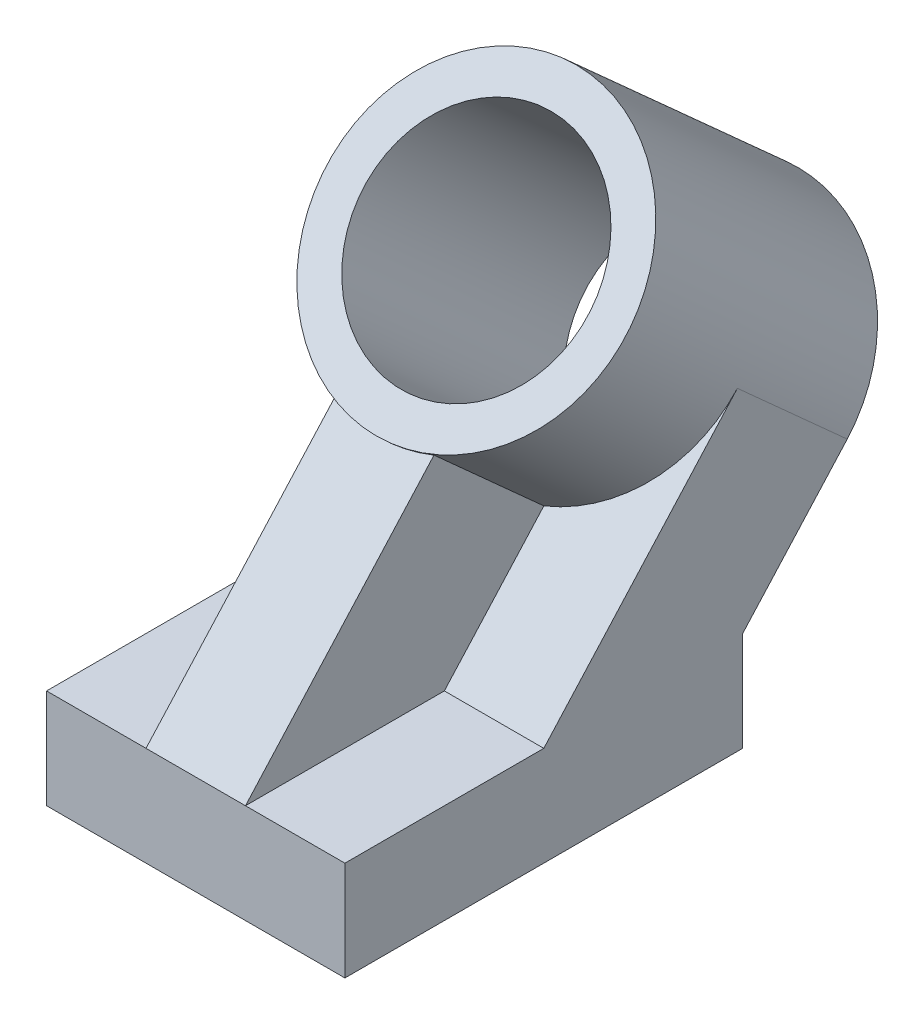
ISO-10303-21;
HEADER;
FILE_DESCRIPTION(('STEP AP214'),'2;1');
FILE_NAME('part.step','',(''),(''),'','','');
FILE_SCHEMA(('AUTOMOTIVE_DESIGN { 1 0 10303 214 1 1 1 1 }'));
ENDSEC;
DATA;
#1=APPLICATION_CONTEXT('core data for automotive mechanical design processes');
#2=APPLICATION_PROTOCOL_DEFINITION('international standard','automotive_design',2000,#1);
#3=PRODUCT_CONTEXT('',#1,'mechanical');
#4=PRODUCT('Part','Part','',(#3));
#5=PRODUCT_RELATED_PRODUCT_CATEGORY('part','',(#4));
#6=PRODUCT_DEFINITION_FORMATION('','',#4);
#7=PRODUCT_DEFINITION_CONTEXT('part definition',#1,'design');
#8=PRODUCT_DEFINITION('design','',#6,#7);
#9=PRODUCT_DEFINITION_SHAPE('','',#8);
#10=(LENGTH_UNIT() NAMED_UNIT(*) SI_UNIT(.MILLI.,.METRE.));
#11=(NAMED_UNIT(*) PLANE_ANGLE_UNIT() SI_UNIT($,.RADIAN.));
#12=(NAMED_UNIT(*) SI_UNIT($,.STERADIAN.) SOLID_ANGLE_UNIT());
#13=UNCERTAINTY_MEASURE_WITH_UNIT(LENGTH_MEASURE(1.E-05),#10,'distance_accuracy_value','');
#14=(GEOMETRIC_REPRESENTATION_CONTEXT(3) GLOBAL_UNCERTAINTY_ASSIGNED_CONTEXT((#13)) GLOBAL_UNIT_ASSIGNED_CONTEXT((#10,
#11,#12)) REPRESENTATION_CONTEXT('',''));
#15=CARTESIAN_POINT('',(0.,0.,0.));
#16=DIRECTION('',(0.,0.,1.));
#17=DIRECTION('',(1.,0.,0.));
#18=AXIS2_PLACEMENT_3D('',#15,#16,#17);
#19=CARTESIAN_POINT('',(38.1,25.4,-50.8));
#20=DIRECTION('',(0.,-0.669130606358859,-0.743144825477393));
#21=DIRECTION('',(0.,0.743144825477393,-0.669130606358859));
#22=AXIS2_PLACEMENT_3D('',#19,#20,#21);
#23=PLANE('',#22);
#24=DIRECTION('',(0.,-0.743144825477393,0.669130606358859));
#25=VECTOR('',#24,1.);
#26=CARTESIAN_POINT('',(38.1,25.4,-50.8));
#27=LINE('',#26,#25);
#28=CARTESIAN_POINT('',(38.1,80.3137421906527,-100.244555555993));
#29=VERTEX_POINT('',#28);
#30=CARTESIAN_POINT('',(38.1,25.4,-50.8));
#31=VERTEX_POINT('',#30);
#32=EDGE_CURVE('E188',#29,#31,#27,.T.);
#33=ORIENTED_EDGE('',*,*,#32,.F.);
#34=CARTESIAN_POINT('',(0.,80.3137421906527,-100.244555555993));
#35=DIRECTION('',(0.,-0.669130606358859,-0.743144825477393));
#36=DIRECTION('',(0.,0.743144825477393,-0.669130606358859));
#37=AXIS2_PLACEMENT_3D('',#34,#35,#36);
#38=CIRCLE('',#37,38.1);
#39=CARTESIAN_POINT('',(12.7,53.6192187193158,-76.2086986617973));
#40=VERTEX_POINT('',#39);
#41=EDGE_CURVE('E55',#29,#40,#38,.T.);
#42=ORIENTED_EDGE('',*,*,#41,.T.);
#43=DIRECTION('',(0.,0.743144825477393,-0.669130606358859));
#44=VECTOR('',#43,1.);
#45=CARTESIAN_POINT('',(12.7,0.139143857645851,-28.0550229669983));
#46=LINE('',#45,#44);
#47=CARTESIAN_POINT('',(12.7,25.4,-50.8));
#48=VERTEX_POINT('',#47);
#49=EDGE_CURVE('E138',#48,#40,#46,.T.);
#50=ORIENTED_EDGE('',*,*,#49,.F.);
#51=DIRECTION('',(-1.,0.,0.));
#52=VECTOR('',#51,1.);
#53=CARTESIAN_POINT('',(38.1,25.4,-50.8));
#54=LINE('',#53,#52);
#55=EDGE_CURVE('E229',#31,#48,#54,.T.);
#56=ORIENTED_EDGE('',*,*,#55,.F.);
#57=EDGE_LOOP('',(#33,#42,#50,#56));
#58=FACE_BOUND('',#57,.T.);
#59=ADVANCED_FACE('F39',(#58),#23,.F.);
#60=CARTESIAN_POINT('',(38.1,25.4,0.));
#61=DIRECTION('',(0.,-1.,0.));
#62=DIRECTION('',(0.,0.,-1.));
#63=AXIS2_PLACEMENT_3D('',#60,#61,#62);
#64=PLANE('',#63);
#65=DIRECTION('',(0.,0.,-1.));
#66=VECTOR('',#65,1.);
#67=CARTESIAN_POINT('',(-12.7,25.4,-68.7419602948247));
#68=LINE('',#67,#66);
#69=CARTESIAN_POINT('',(-12.7,25.4,0.));
#70=VERTEX_POINT('',#69);
#71=CARTESIAN_POINT('',(-12.7,25.4,-50.8));
#72=VERTEX_POINT('',#71);
#73=EDGE_CURVE('E170',#70,#72,#68,.T.);
#74=ORIENTED_EDGE('',*,*,#73,.T.);
#75=CARTESIAN_POINT('',(-38.1,25.4,-50.8));
#76=VERTEX_POINT('',#75);
#77=EDGE_CURVE('E228',#72,#76,#54,.T.);
#78=ORIENTED_EDGE('',*,*,#77,.T.);
#79=DIRECTION('',(0.,0.,1.));
#80=VECTOR('',#79,1.);
#81=CARTESIAN_POINT('',(-38.1,25.4,0.));
#82=LINE('',#81,#80);
#83=CARTESIAN_POINT('',(-38.1,25.4,0.));
#84=VERTEX_POINT('',#83);
#85=EDGE_CURVE('E214',#76,#84,#82,.T.);
#86=ORIENTED_EDGE('',*,*,#85,.T.);
#87=DIRECTION('',(-1.,0.,0.));
#88=VECTOR('',#87,1.);
#89=CARTESIAN_POINT('',(38.1,25.4,0.));
#90=LINE('',#89,#88);
#91=EDGE_CURVE('E223',#70,#84,#90,.T.);
#92=ORIENTED_EDGE('',*,*,#91,.F.);
#93=EDGE_LOOP('',(#74,#78,#86,#92));
#94=FACE_BOUND('',#93,.T.);
#95=ADVANCED_FACE('F266',(#94),#64,.F.);
#96=CARTESIAN_POINT('',(38.1,0.,-101.6));
#97=DIRECTION('',(0.,1.,0.));
#98=DIRECTION('',(0.,0.,1.));
#99=AXIS2_PLACEMENT_3D('',#96,#97,#98);
#100=PLANE('',#99);
#101=DIRECTION('',(0.,0.,-1.));
#102=VECTOR('',#101,1.);
#103=CARTESIAN_POINT('',(-38.1,0.,-101.6));
#104=LINE('',#103,#102);
#105=CARTESIAN_POINT('',(-38.1,0.,0.));
#106=VERTEX_POINT('',#105);
#107=CARTESIAN_POINT('',(-38.1,0.,-101.6));
#108=VERTEX_POINT('',#107);
#109=EDGE_CURVE('E133',#106,#108,#104,.T.);
#110=ORIENTED_EDGE('',*,*,#109,.T.);
#111=DIRECTION('',(-1.,0.,0.));
#112=VECTOR('',#111,1.);
#113=CARTESIAN_POINT('',(38.1,0.,-101.6));
#114=LINE('',#113,#112);
#115=CARTESIAN_POINT('',(38.1,0.,-101.6));
#116=VERTEX_POINT('',#115);
#117=EDGE_CURVE('E48',#116,#108,#114,.T.);
#118=ORIENTED_EDGE('',*,*,#117,.F.);
#119=DIRECTION('',(0.,0.,-1.));
#120=VECTOR('',#119,1.);
#121=CARTESIAN_POINT('',(38.1,0.,-101.6));
#122=LINE('',#121,#120);
#123=CARTESIAN_POINT('',(38.1,0.,0.));
#124=VERTEX_POINT('',#123);
#125=EDGE_CURVE('E174',#124,#116,#122,.T.);
#126=ORIENTED_EDGE('',*,*,#125,.F.);
#127=DIRECTION('',(-1.,0.,0.));
#128=VECTOR('',#127,1.);
#129=CARTESIAN_POINT('',(38.1,0.,0.));
#130=LINE('',#129,#128);
#131=EDGE_CURVE('E197',#124,#106,#130,.T.);
#132=ORIENTED_EDGE('',*,*,#131,.T.);
#133=EDGE_LOOP('',(#110,#118,#126,#132));
#134=FACE_BOUND('',#133,.T.);
#135=ADVANCED_FACE('F41',(#134),#100,.F.);
#136=CARTESIAN_POINT('',(38.1,0.,-101.6));
#137=DIRECTION('',(0.,0.,1.));
#138=DIRECTION('',(1.,0.,0.));
#139=AXIS2_PLACEMENT_3D('',#136,#137,#138);
#140=PLANE('',#139);
#141=DIRECTION('',(0.,1.,0.));
#142=VECTOR('',#141,1.);
#143=CARTESIAN_POINT('',(-38.1,0.,-101.6));
#144=LINE('',#143,#142);
#145=CARTESIAN_POINT('',(-38.1,25.4,-101.6));
#146=VERTEX_POINT('',#145);
#147=EDGE_CURVE('E201',#108,#146,#144,.T.);
#148=ORIENTED_EDGE('',*,*,#147,.T.);
#149=DIRECTION('',(-1.,0.,0.));
#150=VECTOR('',#149,1.);
#151=CARTESIAN_POINT('',(38.1,25.4,-101.6));
#152=LINE('',#151,#150);
#153=CARTESIAN_POINT('',(38.1,25.4,-101.6));
#154=VERTEX_POINT('',#153);
#155=EDGE_CURVE('E233',#154,#146,#152,.T.);
#156=ORIENTED_EDGE('',*,*,#155,.F.);
#157=DIRECTION('',(0.,1.,0.));
#158=VECTOR('',#157,1.);
#159=CARTESIAN_POINT('',(38.1,0.,-101.6));
#160=LINE('',#159,#158);
#161=EDGE_CURVE('E178',#116,#154,#160,.T.);
#162=ORIENTED_EDGE('',*,*,#161,.F.);
#163=ORIENTED_EDGE('',*,*,#117,.T.);
#164=EDGE_LOOP('',(#148,#156,#162,#163));
#165=FACE_BOUND('',#164,.T.);
#166=ADVANCED_FACE('F240',(#165),#140,.F.);
#167=CARTESIAN_POINT('',(38.1,25.4,-101.6));
#168=DIRECTION('',(0.,0.669130606358859,0.743144825477393));
#169=DIRECTION('',(0.,-0.743144825477393,0.669130606358859));
#170=AXIS2_PLACEMENT_3D('',#167,#168,#169);
#171=PLANE('',#170);
#172=CARTESIAN_POINT('',(0.,55.0528860482986,-128.299578522991));
#173=DIRECTION('',(0.,-0.669130606358859,-0.743144825477393));
#174=DIRECTION('',(0.,0.743144825477393,-0.669130606358859));
#175=AXIS2_PLACEMENT_3D('',#172,#173,#174);
#176=CIRCLE('',#175,28.575);
#177=CARTESIAN_POINT('',(0.,76.2882494363151,-147.419985599696));
#178=VERTEX_POINT('',#177);
#179=EDGE_CURVE('E298',#178,#178,#176,.T.);
#180=ORIENTED_EDGE('',*,*,#179,.F.);
#181=EDGE_LOOP('',(#180));
#182=FACE_BOUND('',#181,.T.);
#183=DIRECTION('',(0.,0.743144825477393,-0.66913060635886));
#184=VECTOR('',#183,1.);
#185=CARTESIAN_POINT('',(-38.1,25.4,-101.6));
#186=LINE('',#185,#184);
#187=CARTESIAN_POINT('',(-38.1,55.0528860482986,-128.299578522991));
#188=VERTEX_POINT('',#187);
#189=EDGE_CURVE('E204',#146,#188,#186,.T.);
#190=ORIENTED_EDGE('',*,*,#189,.T.);
#191=CARTESIAN_POINT('',(0.,55.0528860482986,-128.299578522991));
#192=DIRECTION('',(0.,-0.669130606358859,-0.743144825477393));
#193=DIRECTION('',(0.,0.743144825477393,-0.669130606358859));
#194=AXIS2_PLACEMENT_3D('',#191,#192,#193);
#195=CIRCLE('',#194,38.1);
#196=CARTESIAN_POINT('',(38.1,55.0528860482986,-128.299578522991));
#197=VERTEX_POINT('',#196);
#198=EDGE_CURVE('E151',#188,#197,#195,.T.);
#199=ORIENTED_EDGE('',*,*,#198,.T.);
#200=DIRECTION('',(0.,0.743144825477393,-0.66913060635886));
#201=VECTOR('',#200,1.);
#202=CARTESIAN_POINT('',(38.1,25.4,-101.6));
#203=LINE('',#202,#201);
#204=EDGE_CURVE('E182',#154,#197,#203,.T.);
#205=ORIENTED_EDGE('',*,*,#204,.F.);
#206=ORIENTED_EDGE('',*,*,#155,.T.);
#207=EDGE_LOOP('',(#190,#199,#205,#206));
#208=FACE_BOUND('',#207,.T.);
#209=ADVANCED_FACE('F256',(#182,#208),#171,.F.);
#210=DIRECTION('',(0.,0.743144825477393,-0.669130606358859));
#211=VECTOR('',#210,1.);
#212=CARTESIAN_POINT('',(-12.7,0.139143857645851,-28.0550229669983));
#213=LINE('',#212,#211);
#214=CARTESIAN_POINT('',(-12.7,53.6192187193158,-76.2086986617974));
#215=VERTEX_POINT('',#214);
#216=EDGE_CURVE('E160',#72,#215,#213,.T.);
#217=ORIENTED_EDGE('',*,*,#216,.T.);
#218=CARTESIAN_POINT('',(-38.1,80.3137421906527,-100.244555555993));
#219=VERTEX_POINT('',#218);
#220=EDGE_CURVE('E141',#215,#219,#38,.T.);
#221=ORIENTED_EDGE('',*,*,#220,.T.);
#222=DIRECTION('',(0.,-0.743144825477393,0.669130606358859));
#223=VECTOR('',#222,1.);
#224=CARTESIAN_POINT('',(-38.1,25.4,-50.8));
#225=LINE('',#224,#223);
#226=EDGE_CURVE('E210',#219,#76,#225,.T.);
#227=ORIENTED_EDGE('',*,*,#226,.T.);
#228=ORIENTED_EDGE('',*,*,#77,.F.);
#229=EDGE_LOOP('',(#217,#221,#227,#228));
#230=FACE_BOUND('',#229,.T.);
#231=ADVANCED_FACE('F270',(#230),#23,.F.);
#232=ORIENTED_EDGE('',*,*,#55,.T.);
#233=DIRECTION('',(0.,0.,-1.));
#234=VECTOR('',#233,1.);
#235=CARTESIAN_POINT('',(12.7,25.4,-68.7419602948247));
#236=LINE('',#235,#234);
#237=CARTESIAN_POINT('',(12.7,25.4,0.));
#238=VERTEX_POINT('',#237);
#239=EDGE_CURVE('E159',#238,#48,#236,.T.);
#240=ORIENTED_EDGE('',*,*,#239,.F.);
#241=CARTESIAN_POINT('',(38.1,25.4,0.));
#242=VERTEX_POINT('',#241);
#243=EDGE_CURVE('E224',#242,#238,#90,.T.);
#244=ORIENTED_EDGE('',*,*,#243,.F.);
#245=DIRECTION('',(0.,0.,1.));
#246=VECTOR('',#245,1.);
#247=CARTESIAN_POINT('',(38.1,25.4,0.));
#248=LINE('',#247,#246);
#249=EDGE_CURVE('E191',#31,#242,#248,.T.);
#250=ORIENTED_EDGE('',*,*,#249,.F.);
#251=EDGE_LOOP('',(#232,#240,#244,#250));
#252=FACE_BOUND('',#251,.T.);
#253=ADVANCED_FACE('F278',(#252),#64,.F.);
#254=CARTESIAN_POINT('',(38.1,0.,0.));
#255=DIRECTION('',(0.,0.,-1.));
#256=DIRECTION('',(-1.,0.,0.));
#257=AXIS2_PLACEMENT_3D('',#254,#255,#256);
#258=PLANE('',#257);
#259=DIRECTION('',(0.,-1.,0.));
#260=VECTOR('',#259,1.);
#261=CARTESIAN_POINT('',(-38.1,0.,0.));
#262=LINE('',#261,#260);
#263=EDGE_CURVE('E179',#84,#106,#262,.T.);
#264=ORIENTED_EDGE('',*,*,#263,.T.);
#265=ORIENTED_EDGE('',*,*,#131,.F.);
#266=DIRECTION('',(0.,-1.,0.));
#267=VECTOR('',#266,1.);
#268=CARTESIAN_POINT('',(38.1,0.,0.));
#269=LINE('',#268,#267);
#270=EDGE_CURVE('E194',#242,#124,#269,.T.);
#271=ORIENTED_EDGE('',*,*,#270,.F.);
#272=ORIENTED_EDGE('',*,*,#243,.T.);
#273=DIRECTION('',(1.,0.,0.));
#274=VECTOR('',#273,1.);
#275=CARTESIAN_POINT('',(-12.7,25.4,0.));
#276=LINE('',#275,#274);
#277=EDGE_CURVE('E129',#70,#238,#276,.T.);
#278=ORIENTED_EDGE('',*,*,#277,.F.);
#279=ORIENTED_EDGE('',*,*,#91,.T.);
#280=EDGE_LOOP('',(#264,#265,#271,#272,#278,#279));
#281=FACE_BOUND('',#280,.T.);
#282=ADVANCED_FACE('F273',(#281),#258,.F.);
#283=CARTESIAN_POINT('',(38.1,0.,0.));
#284=DIRECTION('',(-1.,0.,0.));
#285=DIRECTION('',(0.,0.,1.));
#286=AXIS2_PLACEMENT_3D('',#283,#284,#285);
#287=PLANE('',#286);
#288=ORIENTED_EDGE('',*,*,#125,.T.);
#289=ORIENTED_EDGE('',*,*,#161,.T.);
#290=ORIENTED_EDGE('',*,*,#204,.T.);
#291=DIRECTION('',(0.,0.669130606358859,0.743144825477393));
#292=VECTOR('',#291,1.);
#293=CARTESIAN_POINT('',(38.1,80.3137421906527,-100.244555555993));
#294=LINE('',#293,#292);
#295=EDGE_CURVE('E185',#197,#29,#294,.T.);
#296=ORIENTED_EDGE('',*,*,#295,.T.);
#297=ORIENTED_EDGE('',*,*,#32,.T.);
#298=ORIENTED_EDGE('',*,*,#249,.T.);
#299=ORIENTED_EDGE('',*,*,#270,.T.);
#300=EDGE_LOOP('',(#288,#289,#290,#296,#297,#298,#299));
#301=FACE_BOUND('',#300,.T.);
#302=ADVANCED_FACE('F260',(#301),#287,.F.);
#303=CARTESIAN_POINT('',(-38.1,0.,0.));
#304=DIRECTION('',(-1.,0.,0.));
#305=DIRECTION('',(0.,0.,1.));
#306=AXIS2_PLACEMENT_3D('',#303,#304,#305);
#307=PLANE('',#306);
#308=ORIENTED_EDGE('',*,*,#109,.F.);
#309=ORIENTED_EDGE('',*,*,#263,.F.);
#310=ORIENTED_EDGE('',*,*,#85,.F.);
#311=ORIENTED_EDGE('',*,*,#226,.F.);
#312=DIRECTION('',(0.,0.669130606358859,0.743144825477393));
#313=VECTOR('',#312,1.);
#314=CARTESIAN_POINT('',(-38.1,80.3137421906527,-100.244555555993));
#315=LINE('',#314,#313);
#316=EDGE_CURVE('E207',#188,#219,#315,.T.);
#317=ORIENTED_EDGE('',*,*,#316,.F.);
#318=ORIENTED_EDGE('',*,*,#189,.F.);
#319=ORIENTED_EDGE('',*,*,#147,.F.);
#320=EDGE_LOOP('',(#308,#309,#310,#311,#317,#318,#319));
#321=FACE_BOUND('',#320,.T.);
#322=ADVANCED_FACE('F248',(#321),#307,.T.);
#323=CARTESIAN_POINT('',(12.7,-36.4955390624219,-68.7419602948247));
#324=DIRECTION('',(1.,0.,0.));
#325=DIRECTION('',(0.,0.,-1.));
#326=AXIS2_PLACEMENT_3D('',#323,#324,#325);
#327=PLANE('',#326);
#328=DIRECTION('',(0.,-0.669130606358859,-0.743144825477393));
#329=VECTOR('',#328,1.);
#330=CARTESIAN_POINT('',(12.7,79.3461147815067,-47.6360859274183));
#331=LINE('',#330,#329);
#332=CARTESIAN_POINT('',(12.7,78.88007486167,-48.153675694799));
#333=VERTEX_POINT('',#332);
#334=EDGE_CURVE('E136',#333,#40,#331,.T.);
#335=ORIENTED_EDGE('',*,*,#334,.F.);
#336=DIRECTION('',(0.,0.743144825477393,-0.669130606358859));
#337=VECTOR('',#336,1.);
#338=CARTESIAN_POINT('',(12.7,25.4,0.));
#339=LINE('',#338,#337);
#340=EDGE_CURVE('E125',#238,#333,#339,.T.);
#341=ORIENTED_EDGE('',*,*,#340,.F.);
#342=ORIENTED_EDGE('',*,*,#239,.T.);
#343=ORIENTED_EDGE('',*,*,#49,.T.);
#344=EDGE_LOOP('',(#335,#341,#342,#343));
#345=FACE_BOUND('',#344,.T.);
#346=ADVANCED_FACE('F137',(#345),#327,.T.);
#347=CARTESIAN_POINT('',(-12.7,-36.4955390624219,-68.7419602948247));
#348=DIRECTION('',(1.,0.,0.));
#349=DIRECTION('',(0.,0.,-1.));
#350=AXIS2_PLACEMENT_3D('',#347,#348,#349);
#351=PLANE('',#350);
#352=DIRECTION('',(0.,0.743144825477393,-0.669130606358859));
#353=VECTOR('',#352,1.);
#354=CARTESIAN_POINT('',(-12.7,25.4,0.));
#355=LINE('',#354,#353);
#356=CARTESIAN_POINT('',(-12.7,78.88007486167,-48.153675694799));
#357=VERTEX_POINT('',#356);
#358=EDGE_CURVE('E162',#70,#357,#355,.T.);
#359=ORIENTED_EDGE('',*,*,#358,.T.);
#360=DIRECTION('',(0.,-0.669130606358859,-0.743144825477393));
#361=VECTOR('',#360,1.);
#362=CARTESIAN_POINT('',(-12.7,79.3461147815068,-47.6360859274183));
#363=LINE('',#362,#361);
#364=EDGE_CURVE('E63',#357,#215,#363,.T.);
#365=ORIENTED_EDGE('',*,*,#364,.T.);
#366=ORIENTED_EDGE('',*,*,#216,.F.);
#367=ORIENTED_EDGE('',*,*,#73,.F.);
#368=EDGE_LOOP('',(#359,#365,#366,#367));
#369=FACE_BOUND('',#368,.T.);
#370=ADVANCED_FACE('F271',(#369),#351,.F.);
#371=CARTESIAN_POINT('',(0.,11.3724885165009,12.6304280711771));
#372=DIRECTION('',(0.,0.669130606358859,0.743144825477393));
#373=DIRECTION('',(0.,-0.743144825477393,0.669130606358859));
#374=AXIS2_PLACEMENT_3D('',#371,#372,#373);
#375=PLANE('',#374);
#376=CARTESIAN_POINT('',(0.,105.574598333007,-72.1895325889945));
#377=DIRECTION('',(0.,0.669130606358859,0.743144825477393));
#378=DIRECTION('',(0.,-0.743144825477393,0.669130606358859));
#379=AXIS2_PLACEMENT_3D('',#376,#377,#378);
#380=CIRCLE('',#379,38.1);
#381=EDGE_CURVE('E11',#357,#333,#380,.T.);
#382=ORIENTED_EDGE('',*,*,#381,.F.);
#383=ORIENTED_EDGE('',*,*,#358,.F.);
#384=ORIENTED_EDGE('',*,*,#277,.T.);
#385=ORIENTED_EDGE('',*,*,#340,.T.);
#386=EDGE_LOOP('',(#382,#383,#384,#385));
#387=FACE_BOUND('',#386,.T.);
#388=ADVANCED_FACE('F127',(#387),#375,.T.);
#389=CARTESIAN_POINT('',(0.,106.040638252844,-71.6719428216138));
#390=DIRECTION('',(0.,-0.669130606358859,-0.743144825477393));
#391=DIRECTION('',(0.,0.743144825477393,-0.669130606358859));
#392=AXIS2_PLACEMENT_3D('',#389,#390,#391);
#393=CYLINDRICAL_SURFACE('',#392,38.1);
#394=CARTESIAN_POINT('',(0.,106.040638252844,-71.6719428216138));
#395=DIRECTION('',(0.,-0.669130606358859,-0.743144825477393));
#396=DIRECTION('',(0.,0.743144825477393,-0.669130606358859));
#397=AXIS2_PLACEMENT_3D('',#394,#395,#396);
#398=CIRCLE('',#397,38.1);
#399=CARTESIAN_POINT('',(0.,134.354456103532,-97.1658189238863));
#400=VERTEX_POINT('',#399);
#401=EDGE_CURVE('E147',#400,#400,#398,.T.);
#402=ORIENTED_EDGE('',*,*,#401,.T.);
#403=EDGE_LOOP('',(#402));
#404=FACE_BOUND('',#403,.T.);
#405=ORIENTED_EDGE('',*,*,#316,.T.);
#406=ORIENTED_EDGE('',*,*,#220,.F.);
#407=ORIENTED_EDGE('',*,*,#364,.F.);
#408=ORIENTED_EDGE('',*,*,#381,.T.);
#409=ORIENTED_EDGE('',*,*,#334,.T.);
#410=ORIENTED_EDGE('',*,*,#41,.F.);
#411=ORIENTED_EDGE('',*,*,#295,.F.);
#412=ORIENTED_EDGE('',*,*,#198,.F.);
#413=EDGE_LOOP('',(#405,#406,#407,#408,#409,#410,#411,#412));
#414=FACE_BOUND('',#413,.T.);
#415=ADVANCED_FACE('F144',(#404,#414),#393,.T.);
#416=CARTESIAN_POINT('',(0.,106.040638252844,-71.6719428216138));
#417=DIRECTION('',(0.,-0.669130606358859,-0.743144825477393));
#418=DIRECTION('',(0.,0.743144825477393,-0.669130606358859));
#419=AXIS2_PLACEMENT_3D('',#416,#417,#418);
#420=PLANE('',#419);
#421=CARTESIAN_POINT('',(0.,106.040638252844,-71.6719428216138));
#422=DIRECTION('',(0.,-0.669130606358859,-0.743144825477393));
#423=DIRECTION('',(0.,0.743144825477393,-0.669130606358859));
#424=AXIS2_PLACEMENT_3D('',#421,#422,#423);
#425=CIRCLE('',#424,28.575);
#426=CARTESIAN_POINT('',(0.,127.27600164086,-90.7923498983182));
#427=VERTEX_POINT('',#426);
#428=EDGE_CURVE('E301',#427,#427,#425,.T.);
#429=ORIENTED_EDGE('',*,*,#428,.T.);
#430=EDGE_LOOP('',(#429));
#431=FACE_BOUND('',#430,.T.);
#432=ORIENTED_EDGE('',*,*,#401,.F.);
#433=EDGE_LOOP('',(#432));
#434=FACE_BOUND('',#433,.T.);
#435=ADVANCED_FACE('F309',(#431,#434),#420,.F.);
#436=CARTESIAN_POINT('',(0.,106.040638252844,-71.6719428216138));
#437=DIRECTION('',(0.,-0.669130606358859,-0.743144825477393));
#438=DIRECTION('',(0.,0.743144825477393,-0.669130606358859));
#439=AXIS2_PLACEMENT_3D('',#436,#437,#438);
#440=CYLINDRICAL_SURFACE('',#439,28.575);
#441=ORIENTED_EDGE('',*,*,#428,.F.);
#442=EDGE_LOOP('',(#441));
#443=FACE_BOUND('',#442,.T.);
#444=ORIENTED_EDGE('',*,*,#179,.T.);
#445=EDGE_LOOP('',(#444));
#446=FACE_BOUND('',#445,.T.);
#447=ADVANCED_FACE('F312',(#443,#446),#440,.F.);
#448=CLOSED_SHELL('',(#59,#95,#135,#166,#209,#231,#253,#282,#302,#322,#346,#370,#388,#415,#435,#447));
#449=MANIFOLD_SOLID_BREP('B2',#448);
#450=ADVANCED_BREP_SHAPE_REPRESENTATION('',(#18,#449),#14);
#451=SHAPE_DEFINITION_REPRESENTATION(#9,#450);
ENDSEC;
END-ISO-10303-21;
